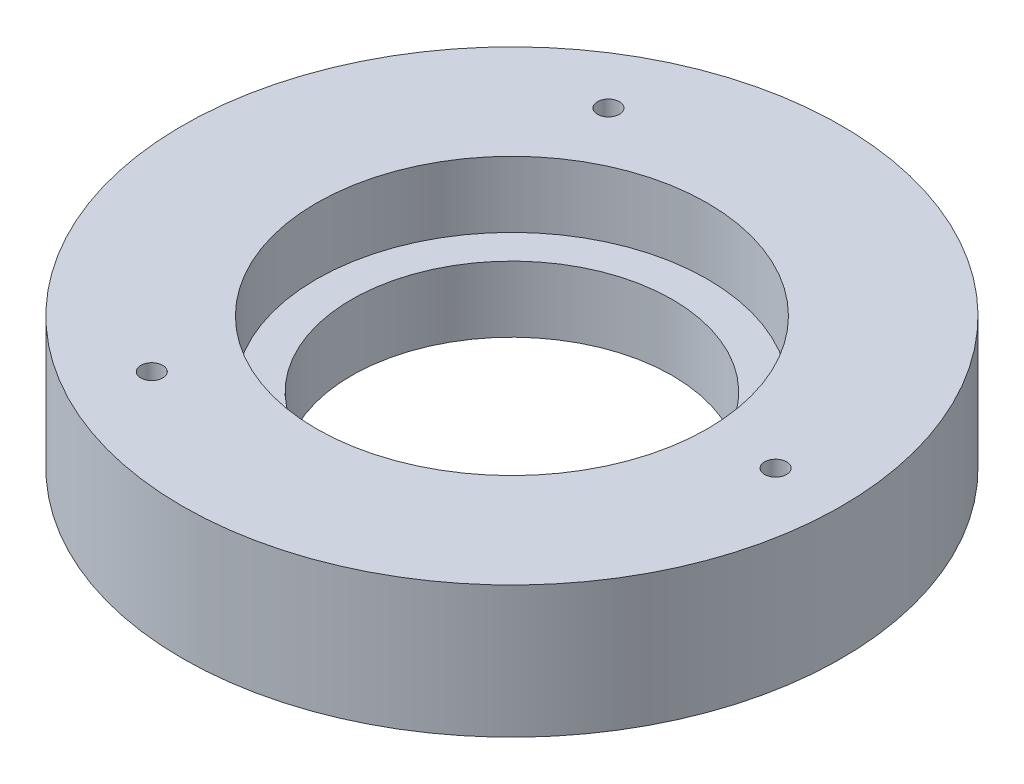
ISO-10303-21;
HEADER;
FILE_DESCRIPTION(('STEP AP214'),'2;1');
FILE_NAME('part.step','',(''),(''),'','','');
FILE_SCHEMA(('AUTOMOTIVE_DESIGN { 1 0 10303 214 1 1 1 1 }'));
ENDSEC;
DATA;
#1=APPLICATION_CONTEXT('core data for automotive mechanical design processes');
#2=APPLICATION_PROTOCOL_DEFINITION('international standard','automotive_design',2000,#1);
#3=PRODUCT_CONTEXT('',#1,'mechanical');
#4=PRODUCT('Part','Part','',(#3));
#5=PRODUCT_RELATED_PRODUCT_CATEGORY('part','',(#4));
#6=PRODUCT_DEFINITION_FORMATION('','',#4);
#7=PRODUCT_DEFINITION_CONTEXT('part definition',#1,'design');
#8=PRODUCT_DEFINITION('design','',#6,#7);
#9=PRODUCT_DEFINITION_SHAPE('','',#8);
#10=(LENGTH_UNIT() NAMED_UNIT(*) SI_UNIT(.MILLI.,.METRE.));
#11=(NAMED_UNIT(*) PLANE_ANGLE_UNIT() SI_UNIT($,.RADIAN.));
#12=(NAMED_UNIT(*) SI_UNIT($,.STERADIAN.) SOLID_ANGLE_UNIT());
#13=UNCERTAINTY_MEASURE_WITH_UNIT(LENGTH_MEASURE(1.E-05),#10,'distance_accuracy_value','');
#14=(GEOMETRIC_REPRESENTATION_CONTEXT(3) GLOBAL_UNCERTAINTY_ASSIGNED_CONTEXT((#13)) GLOBAL_UNIT_ASSIGNED_CONTEXT((#10,
#11,#12)) REPRESENTATION_CONTEXT('',''));
#15=CARTESIAN_POINT('',(0.,0.,0.));
#16=DIRECTION('',(0.,0.,1.));
#17=DIRECTION('',(1.,0.,0.));
#18=AXIS2_PLACEMENT_3D('',#15,#16,#17);
#19=CARTESIAN_POINT('',(0.,19.05,0.));
#20=DIRECTION('',(0.,-1.,0.));
#21=DIRECTION('',(0.,0.,-1.));
#22=AXIS2_PLACEMENT_3D('',#19,#20,#21);
#23=CYLINDRICAL_SURFACE('',#22,95.25);
#24=CARTESIAN_POINT('',(0.,19.05,0.));
#25=DIRECTION('',(0.,1.,0.));
#26=DIRECTION('',(0.,0.,1.));
#27=AXIS2_PLACEMENT_3D('',#24,#25,#26);
#28=CIRCLE('',#27,95.25);
#29=CARTESIAN_POINT('',(0.,19.05,95.25));
#30=VERTEX_POINT('',#29);
#31=EDGE_CURVE('E10',#30,#30,#28,.T.);
#32=ORIENTED_EDGE('',*,*,#31,.F.);
#33=EDGE_LOOP('',(#32));
#34=FACE_BOUND('',#33,.T.);
#35=CARTESIAN_POINT('',(0.,-19.05,0.));
#36=DIRECTION('',(0.,1.,0.));
#37=DIRECTION('',(0.,0.,1.));
#38=AXIS2_PLACEMENT_3D('',#35,#36,#37);
#39=CIRCLE('',#38,95.25);
#40=CARTESIAN_POINT('',(0.,-19.05,95.25));
#41=VERTEX_POINT('',#40);
#42=EDGE_CURVE('E39',#41,#41,#39,.T.);
#43=ORIENTED_EDGE('',*,*,#42,.T.);
#44=EDGE_LOOP('',(#43));
#45=FACE_BOUND('',#44,.T.);
#46=ADVANCED_FACE('F36',(#34,#45),#23,.T.);
#47=CARTESIAN_POINT('',(0.,19.05,0.));
#48=DIRECTION('',(0.,1.,0.));
#49=DIRECTION('',(0.,0.,1.));
#50=AXIS2_PLACEMENT_3D('',#47,#48,#49);
#51=PLANE('',#50);
#52=CARTESIAN_POINT('',(-38.1000000000003,19.05,-65.9911357683741));
#53=DIRECTION('',(0.,1.,0.));
#54=DIRECTION('',(0.866025403784436,0.,-0.500000000000004));
#55=AXIS2_PLACEMENT_3D('',#52,#53,#54);
#56=CIRCLE('',#55,3.175);
#57=CARTESIAN_POINT('',(-35.3503693429847,19.05,-67.5786357683741));
#58=VERTEX_POINT('',#57);
#59=EDGE_CURVE('E65',#58,#58,#56,.T.);
#60=ORIENTED_EDGE('',*,*,#59,.F.);
#61=EDGE_LOOP('',(#60));
#62=FACE_BOUND('',#61,.T.);
#63=CARTESIAN_POINT('',(-38.0999999999994,19.05,65.9911357683746));
#64=DIRECTION('',(0.,1.,0.));
#65=DIRECTION('',(-0.866025403784443,0.,-0.499999999999992));
#66=AXIS2_PLACEMENT_3D('',#63,#64,#65);
#67=CIRCLE('',#66,3.175);
#68=CARTESIAN_POINT('',(-40.849630657015,19.05,64.4036357683746));
#69=VERTEX_POINT('',#68);
#70=EDGE_CURVE('E66',#69,#69,#67,.T.);
#71=ORIENTED_EDGE('',*,*,#70,.F.);
#72=EDGE_LOOP('',(#71));
#73=FACE_BOUND('',#72,.T.);
#74=CARTESIAN_POINT('',(76.2,19.05,0.));
#75=DIRECTION('',(0.,1.,0.));
#76=DIRECTION('',(0.,0.,1.));
#77=AXIS2_PLACEMENT_3D('',#74,#75,#76);
#78=CIRCLE('',#77,3.175);
#79=CARTESIAN_POINT('',(76.2,19.05,3.175));
#80=VERTEX_POINT('',#79);
#81=EDGE_CURVE('E62',#80,#80,#78,.T.);
#82=ORIENTED_EDGE('',*,*,#81,.F.);
#83=EDGE_LOOP('',(#82));
#84=FACE_BOUND('',#83,.T.);
#85=CARTESIAN_POINT('',(0.,19.05,0.));
#86=DIRECTION('',(0.,1.,0.));
#87=DIRECTION('',(0.,0.,1.));
#88=AXIS2_PLACEMENT_3D('',#85,#86,#87);
#89=CIRCLE('',#88,56.515);
#90=CARTESIAN_POINT('',(0.,19.05,56.515));
#91=VERTEX_POINT('',#90);
#92=EDGE_CURVE('E48',#91,#91,#89,.T.);
#93=ORIENTED_EDGE('',*,*,#92,.F.);
#94=EDGE_LOOP('',(#93));
#95=FACE_BOUND('',#94,.T.);
#96=ORIENTED_EDGE('',*,*,#31,.T.);
#97=EDGE_LOOP('',(#96));
#98=FACE_BOUND('',#97,.T.);
#99=ADVANCED_FACE('F102',(#62,#73,#84,#95,#98),#51,.T.);
#100=CARTESIAN_POINT('',(0.,-19.05,0.));
#101=DIRECTION('',(0.,1.,0.));
#102=DIRECTION('',(0.,0.,1.));
#103=AXIS2_PLACEMENT_3D('',#100,#101,#102);
#104=PLANE('',#103);
#105=CARTESIAN_POINT('',(-89.535,-19.05,-4.09394740330526E-13));
#106=DIRECTION('',(0.,-1.,0.));
#107=DIRECTION('',(0.866025403784436,0.,0.500000000000004));
#108=AXIS2_PLACEMENT_3D('',#105,#106,#107);
#109=CIRCLE('',#108,3.175);
#110=CARTESIAN_POINT('',(-86.7853693429844,-19.05,1.5874999999996));
#111=VERTEX_POINT('',#110);
#112=EDGE_CURVE('E87',#111,#111,#109,.T.);
#113=ORIENTED_EDGE('',*,*,#112,.F.);
#114=EDGE_LOOP('',(#113));
#115=FACE_BOUND('',#114,.T.);
#116=CARTESIAN_POINT('',(44.7675000000007,-19.05,-77.5395845278393));
#117=DIRECTION('',(0.,-1.,0.));
#118=DIRECTION('',(-0.866025403784443,0.,0.499999999999992));
#119=AXIS2_PLACEMENT_3D('',#116,#117,#118);
#120=CIRCLE('',#119,3.175);
#121=CARTESIAN_POINT('',(42.0178693429851,-19.05,-75.9520845278393));
#122=VERTEX_POINT('',#121);
#123=EDGE_CURVE('E88',#122,#122,#120,.T.);
#124=ORIENTED_EDGE('',*,*,#123,.F.);
#125=EDGE_LOOP('',(#124));
#126=FACE_BOUND('',#125,.T.);
#127=CARTESIAN_POINT('',(44.7675,-19.05,77.5395845278397));
#128=DIRECTION('',(0.,-1.,0.));
#129=DIRECTION('',(0.,0.,-1.));
#130=AXIS2_PLACEMENT_3D('',#127,#128,#129);
#131=CIRCLE('',#130,3.175);
#132=CARTESIAN_POINT('',(44.7675,-19.05,74.3645845278397));
#133=VERTEX_POINT('',#132);
#134=EDGE_CURVE('E78',#133,#133,#131,.T.);
#135=ORIENTED_EDGE('',*,*,#134,.F.);
#136=EDGE_LOOP('',(#135));
#137=FACE_BOUND('',#136,.T.);
#138=CARTESIAN_POINT('',(-38.1000000000003,-19.05,-65.9911357683741));
#139=DIRECTION('',(0.,1.,0.));
#140=DIRECTION('',(0.866025403784436,0.,-0.500000000000004));
#141=AXIS2_PLACEMENT_3D('',#138,#139,#140);
#142=CIRCLE('',#141,3.175);
#143=CARTESIAN_POINT('',(-35.3503693429847,-19.05,-67.5786357683741));
#144=VERTEX_POINT('',#143);
#145=EDGE_CURVE('E69',#144,#144,#142,.F.);
#146=ORIENTED_EDGE('',*,*,#145,.F.);
#147=EDGE_LOOP('',(#146));
#148=FACE_BOUND('',#147,.T.);
#149=CARTESIAN_POINT('',(-38.0999999999994,-19.05,65.9911357683746));
#150=DIRECTION('',(0.,1.,0.));
#151=DIRECTION('',(-0.866025403784443,0.,-0.499999999999992));
#152=AXIS2_PLACEMENT_3D('',#149,#150,#151);
#153=CIRCLE('',#152,3.175);
#154=CARTESIAN_POINT('',(-40.849630657015,-19.05,64.4036357683746));
#155=VERTEX_POINT('',#154);
#156=EDGE_CURVE('E70',#155,#155,#153,.F.);
#157=ORIENTED_EDGE('',*,*,#156,.F.);
#158=EDGE_LOOP('',(#157));
#159=FACE_BOUND('',#158,.T.);
#160=CARTESIAN_POINT('',(76.2,-19.05,0.));
#161=DIRECTION('',(0.,1.,0.));
#162=DIRECTION('',(0.,0.,1.));
#163=AXIS2_PLACEMENT_3D('',#160,#161,#162);
#164=CIRCLE('',#163,3.175);
#165=CARTESIAN_POINT('',(76.2,-19.05,3.175));
#166=VERTEX_POINT('',#165);
#167=EDGE_CURVE('E59',#166,#166,#164,.F.);
#168=ORIENTED_EDGE('',*,*,#167,.F.);
#169=EDGE_LOOP('',(#168));
#170=FACE_BOUND('',#169,.T.);
#171=CARTESIAN_POINT('',(0.,-19.05,0.));
#172=DIRECTION('',(0.,-1.,0.));
#173=DIRECTION('',(0.,0.,-1.));
#174=AXIS2_PLACEMENT_3D('',#171,#172,#173);
#175=CIRCLE('',#174,46.355);
#176=CARTESIAN_POINT('',(0.,-19.05,-46.355));
#177=VERTEX_POINT('',#176);
#178=EDGE_CURVE('E56',#177,#177,#175,.T.);
#179=ORIENTED_EDGE('',*,*,#178,.F.);
#180=EDGE_LOOP('',(#179));
#181=FACE_BOUND('',#180,.T.);
#182=ORIENTED_EDGE('',*,*,#42,.F.);
#183=EDGE_LOOP('',(#182));
#184=FACE_BOUND('',#183,.T.);
#185=ADVANCED_FACE('F98',(#115,#126,#137,#148,#159,#170,#181,#184),#104,.F.);
#186=CARTESIAN_POINT('',(0.,0.,0.));
#187=DIRECTION('',(0.,1.,0.));
#188=DIRECTION('',(0.,0.,1.));
#189=AXIS2_PLACEMENT_3D('',#186,#187,#188);
#190=CYLINDRICAL_SURFACE('',#189,56.515);
#191=CARTESIAN_POINT('',(0.,0.,0.));
#192=DIRECTION('',(0.,1.,0.));
#193=DIRECTION('',(0.,0.,1.));
#194=AXIS2_PLACEMENT_3D('',#191,#192,#193);
#195=CIRCLE('',#194,56.515);
#196=CARTESIAN_POINT('',(0.,0.,56.515));
#197=VERTEX_POINT('',#196);
#198=EDGE_CURVE('E46',#197,#197,#195,.T.);
#199=ORIENTED_EDGE('',*,*,#198,.F.);
#200=EDGE_LOOP('',(#199));
#201=FACE_BOUND('',#200,.T.);
#202=ORIENTED_EDGE('',*,*,#92,.T.);
#203=EDGE_LOOP('',(#202));
#204=FACE_BOUND('',#203,.T.);
#205=ADVANCED_FACE('F101',(#201,#204),#190,.F.);
#206=CARTESIAN_POINT('',(0.,0.,0.));
#207=DIRECTION('',(0.,1.,0.));
#208=DIRECTION('',(0.,0.,1.));
#209=AXIS2_PLACEMENT_3D('',#206,#207,#208);
#210=PLANE('',#209);
#211=CARTESIAN_POINT('',(0.,0.,0.));
#212=DIRECTION('',(0.,1.,0.));
#213=DIRECTION('',(0.,0.,1.));
#214=AXIS2_PLACEMENT_3D('',#211,#212,#213);
#215=CIRCLE('',#214,46.355);
#216=CARTESIAN_POINT('',(0.,0.,46.355));
#217=VERTEX_POINT('',#216);
#218=EDGE_CURVE('E51',#217,#217,#215,.F.);
#219=ORIENTED_EDGE('',*,*,#218,.T.);
#220=EDGE_LOOP('',(#219));
#221=FACE_BOUND('',#220,.T.);
#222=ORIENTED_EDGE('',*,*,#198,.T.);
#223=EDGE_LOOP('',(#222));
#224=FACE_BOUND('',#223,.T.);
#225=ADVANCED_FACE('F131',(#221,#224),#210,.T.);
#226=CARTESIAN_POINT('',(0.,131.11173936761,0.));
#227=DIRECTION('',(0.,-1.,0.));
#228=DIRECTION('',(0.,0.,-1.));
#229=AXIS2_PLACEMENT_3D('',#226,#227,#228);
#230=CYLINDRICAL_SURFACE('',#229,46.355);
#231=ORIENTED_EDGE('',*,*,#178,.T.);
#232=EDGE_LOOP('',(#231));
#233=FACE_BOUND('',#232,.T.);
#234=ORIENTED_EDGE('',*,*,#218,.F.);
#235=EDGE_LOOP('',(#234));
#236=FACE_BOUND('',#235,.T.);
#237=ADVANCED_FACE('F135',(#233,#236),#230,.F.);
#238=CARTESIAN_POINT('',(76.2,-28.0302561210691,0.));
#239=DIRECTION('',(0.,1.,0.));
#240=DIRECTION('',(0.,0.,1.));
#241=AXIS2_PLACEMENT_3D('',#238,#239,#240);
#242=CYLINDRICAL_SURFACE('',#241,3.175);
#243=ORIENTED_EDGE('',*,*,#167,.T.);
#244=EDGE_LOOP('',(#243));
#245=FACE_BOUND('',#244,.T.);
#246=ORIENTED_EDGE('',*,*,#81,.T.);
#247=EDGE_LOOP('',(#246));
#248=FACE_BOUND('',#247,.T.);
#249=ADVANCED_FACE('F139',(#245,#248),#242,.F.);
#250=CARTESIAN_POINT('',(-38.0999999999994,-28.0302561210691,65.9911357683746));
#251=DIRECTION('',(0.,1.,0.));
#252=DIRECTION('',(-0.866025403784443,0.,-0.499999999999992));
#253=AXIS2_PLACEMENT_3D('',#250,#251,#252);
#254=CYLINDRICAL_SURFACE('',#253,3.175);
#255=ORIENTED_EDGE('',*,*,#156,.T.);
#256=EDGE_LOOP('',(#255));
#257=FACE_BOUND('',#256,.T.);
#258=ORIENTED_EDGE('',*,*,#70,.T.);
#259=EDGE_LOOP('',(#258));
#260=FACE_BOUND('',#259,.T.);
#261=ADVANCED_FACE('F143',(#257,#260),#254,.F.);
#262=CARTESIAN_POINT('',(-38.1000000000003,-28.0302561210691,-65.9911357683741));
#263=DIRECTION('',(0.,1.,0.));
#264=DIRECTION('',(0.866025403784436,0.,-0.500000000000004));
#265=AXIS2_PLACEMENT_3D('',#262,#263,#264);
#266=CYLINDRICAL_SURFACE('',#265,3.175);
#267=ORIENTED_EDGE('',*,*,#145,.T.);
#268=EDGE_LOOP('',(#267));
#269=FACE_BOUND('',#268,.T.);
#270=ORIENTED_EDGE('',*,*,#59,.T.);
#271=EDGE_LOOP('',(#270));
#272=FACE_BOUND('',#271,.T.);
#273=ADVANCED_FACE('F147',(#269,#272),#266,.F.);
#274=CARTESIAN_POINT('',(44.7675,0.,77.5395845278397));
#275=DIRECTION('',(0.,-1.,0.));
#276=DIRECTION('',(0.,0.,-1.));
#277=AXIS2_PLACEMENT_3D('',#274,#275,#276);
#278=CYLINDRICAL_SURFACE('',#277,3.175);
#279=CARTESIAN_POINT('',(44.7675,0.,77.5395845278397));
#280=DIRECTION('',(0.,-1.,0.));
#281=DIRECTION('',(0.,0.,-1.));
#282=AXIS2_PLACEMENT_3D('',#279,#280,#281);
#283=CIRCLE('',#282,3.175);
#284=CARTESIAN_POINT('',(44.7675,0.,74.3645845278397));
#285=VERTEX_POINT('',#284);
#286=EDGE_CURVE('E73',#285,#285,#283,.T.);
#287=ORIENTED_EDGE('',*,*,#286,.F.);
#288=EDGE_LOOP('',(#287));
#289=FACE_BOUND('',#288,.T.);
#290=ORIENTED_EDGE('',*,*,#134,.T.);
#291=EDGE_LOOP('',(#290));
#292=FACE_BOUND('',#291,.T.);
#293=ADVANCED_FACE('F151',(#289,#292),#278,.F.);
#294=CARTESIAN_POINT('',(44.7675,0.,77.5395845278397));
#295=DIRECTION('',(0.,-1.,0.));
#296=DIRECTION('',(0.,0.,-1.));
#297=AXIS2_PLACEMENT_3D('',#294,#295,#296);
#298=PLANE('',#297);
#299=ORIENTED_EDGE('',*,*,#286,.T.);
#300=EDGE_LOOP('',(#299));
#301=FACE_BOUND('',#300,.T.);
#302=ADVANCED_FACE('F155',(#301),#298,.T.);
#303=CARTESIAN_POINT('',(44.7675000000007,0.,-77.5395845278393));
#304=DIRECTION('',(0.,-1.,0.));
#305=DIRECTION('',(-0.866025403784443,0.,0.499999999999992));
#306=AXIS2_PLACEMENT_3D('',#303,#304,#305);
#307=CYLINDRICAL_SURFACE('',#306,3.175);
#308=CARTESIAN_POINT('',(44.7675000000007,0.,-77.5395845278393));
#309=DIRECTION('',(0.,-1.,0.));
#310=DIRECTION('',(-0.866025403784443,0.,0.499999999999992));
#311=AXIS2_PLACEMENT_3D('',#308,#309,#310);
#312=CIRCLE('',#311,3.175);
#313=CARTESIAN_POINT('',(42.0178693429851,0.,-75.9520845278393));
#314=VERTEX_POINT('',#313);
#315=EDGE_CURVE('E84',#314,#314,#312,.T.);
#316=ORIENTED_EDGE('',*,*,#315,.F.);
#317=EDGE_LOOP('',(#316));
#318=FACE_BOUND('',#317,.T.);
#319=ORIENTED_EDGE('',*,*,#123,.T.);
#320=EDGE_LOOP('',(#319));
#321=FACE_BOUND('',#320,.T.);
#322=ADVANCED_FACE('F159',(#318,#321),#307,.F.);
#323=CARTESIAN_POINT('',(44.7675000000007,0.,-77.5395845278393));
#324=DIRECTION('',(0.,-1.,0.));
#325=DIRECTION('',(-0.866025403784443,0.,0.499999999999992));
#326=AXIS2_PLACEMENT_3D('',#323,#324,#325);
#327=PLANE('',#326);
#328=ORIENTED_EDGE('',*,*,#315,.T.);
#329=EDGE_LOOP('',(#328));
#330=FACE_BOUND('',#329,.T.);
#331=ADVANCED_FACE('F163',(#330),#327,.T.);
#332=CARTESIAN_POINT('',(-89.535,0.,-4.09394740330526E-13));
#333=DIRECTION('',(0.,-1.,0.));
#334=DIRECTION('',(0.866025403784436,0.,0.500000000000004));
#335=AXIS2_PLACEMENT_3D('',#332,#333,#334);
#336=CYLINDRICAL_SURFACE('',#335,3.175);
#337=CARTESIAN_POINT('',(-89.535,0.,-4.09394740330526E-13));
#338=DIRECTION('',(0.,-1.,0.));
#339=DIRECTION('',(0.866025403784436,0.,0.500000000000004));
#340=AXIS2_PLACEMENT_3D('',#337,#338,#339);
#341=CIRCLE('',#340,3.175);
#342=CARTESIAN_POINT('',(-86.7853693429844,0.,1.5874999999996));
#343=VERTEX_POINT('',#342);
#344=EDGE_CURVE('E81',#343,#343,#341,.T.);
#345=ORIENTED_EDGE('',*,*,#344,.F.);
#346=EDGE_LOOP('',(#345));
#347=FACE_BOUND('',#346,.T.);
#348=ORIENTED_EDGE('',*,*,#112,.T.);
#349=EDGE_LOOP('',(#348));
#350=FACE_BOUND('',#349,.T.);
#351=ADVANCED_FACE('F96',(#347,#350),#336,.F.);
#352=CARTESIAN_POINT('',(-89.535,0.,-4.09394740330526E-13));
#353=DIRECTION('',(0.,-1.,0.));
#354=DIRECTION('',(0.866025403784436,0.,0.500000000000004));
#355=AXIS2_PLACEMENT_3D('',#352,#353,#354);
#356=PLANE('',#355);
#357=ORIENTED_EDGE('',*,*,#344,.T.);
#358=EDGE_LOOP('',(#357));
#359=FACE_BOUND('',#358,.T.);
#360=ADVANCED_FACE('F170',(#359),#356,.T.);
#361=CLOSED_SHELL('',(#46,#99,#185,#205,#225,#237,#249,#261,#273,#293,#302,#322,#331,#351,#360));
#362=MANIFOLD_SOLID_BREP('B2',#361);
#363=ADVANCED_BREP_SHAPE_REPRESENTATION('',(#18,#362),#14);
#364=SHAPE_DEFINITION_REPRESENTATION(#9,#363);
ENDSEC;
END-ISO-10303-21;
